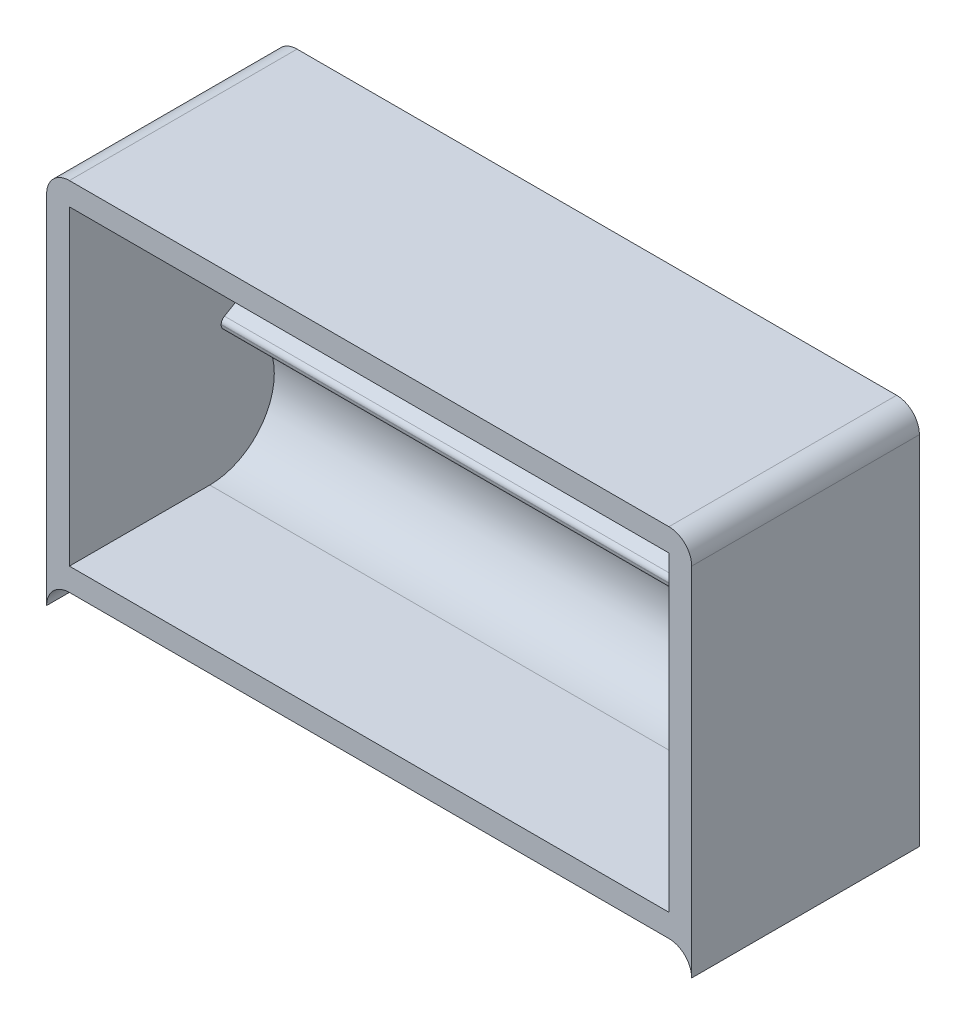
ISO-10303-21;
HEADER;
FILE_DESCRIPTION(('STEP AP214'),'2;1');
FILE_NAME('part.step','',(''),(''),'','','');
FILE_SCHEMA(('AUTOMOTIVE_DESIGN { 1 0 10303 214 1 1 1 1 }'));
ENDSEC;
DATA;
#1=APPLICATION_CONTEXT('core data for automotive mechanical design processes');
#2=APPLICATION_PROTOCOL_DEFINITION('international standard','automotive_design',2000,#1);
#3=PRODUCT_CONTEXT('',#1,'mechanical');
#4=PRODUCT('Part','Part','',(#3));
#5=PRODUCT_RELATED_PRODUCT_CATEGORY('part','',(#4));
#6=PRODUCT_DEFINITION_FORMATION('','',#4);
#7=PRODUCT_DEFINITION_CONTEXT('part definition',#1,'design');
#8=PRODUCT_DEFINITION('design','',#6,#7);
#9=PRODUCT_DEFINITION_SHAPE('','',#8);
#10=(LENGTH_UNIT() NAMED_UNIT(*) SI_UNIT(.MILLI.,.METRE.));
#11=(NAMED_UNIT(*) PLANE_ANGLE_UNIT() SI_UNIT($,.RADIAN.));
#12=(NAMED_UNIT(*) SI_UNIT($,.STERADIAN.) SOLID_ANGLE_UNIT());
#13=UNCERTAINTY_MEASURE_WITH_UNIT(LENGTH_MEASURE(1.E-05),#10,'distance_accuracy_value','');
#14=(GEOMETRIC_REPRESENTATION_CONTEXT(3) GLOBAL_UNCERTAINTY_ASSIGNED_CONTEXT((#13)) GLOBAL_UNIT_ASSIGNED_CONTEXT((#10,
#11,#12)) REPRESENTATION_CONTEXT('',''));
#15=CARTESIAN_POINT('',(0.,0.,0.));
#16=DIRECTION('',(0.,0.,1.));
#17=DIRECTION('',(1.,0.,0.));
#18=AXIS2_PLACEMENT_3D('',#15,#16,#17);
#19=CARTESIAN_POINT('',(82.,44.,30.));
#20=DIRECTION('',(0.,0.,-1.));
#21=DIRECTION('',(-1.,0.,0.));
#22=AXIS2_PLACEMENT_3D('',#19,#20,#21);
#23=CYLINDRICAL_SURFACE('',#22,3.);
#24=CARTESIAN_POINT('',(82.,44.,0.));
#25=DIRECTION('',(0.,0.,1.));
#26=DIRECTION('',(-1.,0.,0.));
#27=AXIS2_PLACEMENT_3D('',#24,#25,#26);
#28=CIRCLE('',#27,3.);
#29=CARTESIAN_POINT('',(85.,44.,0.));
#30=VERTEX_POINT('',#29);
#31=CARTESIAN_POINT('',(82.,47.,0.));
#32=VERTEX_POINT('',#31);
#33=EDGE_CURVE('E154',#30,#32,#28,.T.);
#34=ORIENTED_EDGE('',*,*,#33,.T.);
#35=DIRECTION('',(0.,0.,-1.));
#36=VECTOR('',#35,1.);
#37=CARTESIAN_POINT('',(82.,47.,30.));
#38=LINE('',#37,#36);
#39=CARTESIAN_POINT('',(82.,47.,30.));
#40=VERTEX_POINT('',#39);
#41=EDGE_CURVE('E12',#40,#32,#38,.T.);
#42=ORIENTED_EDGE('',*,*,#41,.F.);
#43=CARTESIAN_POINT('',(82.,44.,30.));
#44=DIRECTION('',(0.,0.,1.));
#45=DIRECTION('',(-1.,0.,0.));
#46=AXIS2_PLACEMENT_3D('',#43,#44,#45);
#47=CIRCLE('',#46,3.);
#48=CARTESIAN_POINT('',(85.,44.,30.));
#49=VERTEX_POINT('',#48);
#50=EDGE_CURVE('E178',#49,#40,#47,.T.);
#51=ORIENTED_EDGE('',*,*,#50,.F.);
#52=DIRECTION('',(0.,0.,-1.));
#53=VECTOR('',#52,1.);
#54=CARTESIAN_POINT('',(85.,44.,30.));
#55=LINE('',#54,#53);
#56=EDGE_CURVE('E150',#49,#30,#55,.T.);
#57=ORIENTED_EDGE('',*,*,#56,.T.);
#58=EDGE_LOOP('',(#34,#42,#51,#57));
#59=FACE_BOUND('',#58,.T.);
#60=ADVANCED_FACE('F41',(#59),#23,.T.);
#61=CARTESIAN_POINT('',(3.,47.,30.));
#62=DIRECTION('',(0.,-1.,0.));
#63=DIRECTION('',(0.,0.,-1.));
#64=AXIS2_PLACEMENT_3D('',#61,#62,#63);
#65=PLANE('',#64);
#66=DIRECTION('',(-1.,0.,0.));
#67=VECTOR('',#66,1.);
#68=CARTESIAN_POINT('',(3.,47.,0.));
#69=LINE('',#68,#67);
#70=CARTESIAN_POINT('',(3.,47.,0.));
#71=VERTEX_POINT('',#70);
#72=EDGE_CURVE('E158',#32,#71,#69,.T.);
#73=ORIENTED_EDGE('',*,*,#72,.T.);
#74=DIRECTION('',(0.,0.,-1.));
#75=VECTOR('',#74,1.);
#76=CARTESIAN_POINT('',(3.,47.,30.));
#77=LINE('',#76,#75);
#78=CARTESIAN_POINT('',(3.,47.,30.));
#79=VERTEX_POINT('',#78);
#80=EDGE_CURVE('E49',#79,#71,#77,.T.);
#81=ORIENTED_EDGE('',*,*,#80,.F.);
#82=DIRECTION('',(-1.,0.,0.));
#83=VECTOR('',#82,1.);
#84=CARTESIAN_POINT('',(3.,47.,30.));
#85=LINE('',#84,#83);
#86=EDGE_CURVE('E106',#40,#79,#85,.T.);
#87=ORIENTED_EDGE('',*,*,#86,.F.);
#88=ORIENTED_EDGE('',*,*,#41,.T.);
#89=EDGE_LOOP('',(#73,#81,#87,#88));
#90=FACE_BOUND('',#89,.T.);
#91=ADVANCED_FACE('F388',(#90),#65,.F.);
#92=CARTESIAN_POINT('',(2.99999999999998,44.,30.));
#93=DIRECTION('',(0.,0.,-1.));
#94=DIRECTION('',(-1.,0.,0.));
#95=AXIS2_PLACEMENT_3D('',#92,#93,#94);
#96=CYLINDRICAL_SURFACE('',#95,3.);
#97=CARTESIAN_POINT('',(2.99999999999998,44.,0.));
#98=DIRECTION('',(0.,0.,1.));
#99=DIRECTION('',(-1.,0.,0.));
#100=AXIS2_PLACEMENT_3D('',#97,#98,#99);
#101=CIRCLE('',#100,3.);
#102=CARTESIAN_POINT('',(0.,44.,0.));
#103=VERTEX_POINT('',#102);
#104=EDGE_CURVE('E162',#71,#103,#101,.T.);
#105=ORIENTED_EDGE('',*,*,#104,.T.);
#106=DIRECTION('',(0.,0.,-1.));
#107=VECTOR('',#106,1.);
#108=CARTESIAN_POINT('',(0.,44.,30.));
#109=LINE('',#108,#107);
#110=CARTESIAN_POINT('',(0.,44.,30.));
#111=VERTEX_POINT('',#110);
#112=EDGE_CURVE('E189',#111,#103,#109,.T.);
#113=ORIENTED_EDGE('',*,*,#112,.F.);
#114=CARTESIAN_POINT('',(2.99999999999998,44.,30.));
#115=DIRECTION('',(0.,0.,1.));
#116=DIRECTION('',(-1.,0.,0.));
#117=AXIS2_PLACEMENT_3D('',#114,#115,#116);
#118=CIRCLE('',#117,3.);
#119=EDGE_CURVE('E199',#79,#111,#118,.T.);
#120=ORIENTED_EDGE('',*,*,#119,.F.);
#121=ORIENTED_EDGE('',*,*,#80,.T.);
#122=EDGE_LOOP('',(#105,#113,#120,#121));
#123=FACE_BOUND('',#122,.T.);
#124=ADVANCED_FACE('F197',(#123),#96,.T.);
#125=CARTESIAN_POINT('',(-3.33066907387547E-13,-3.,30.));
#126=DIRECTION('',(1.,0.,0.));
#127=DIRECTION('',(0.,1.,0.));
#128=AXIS2_PLACEMENT_3D('',#125,#126,#127);
#129=PLANE('',#128);
#130=DIRECTION('',(0.,-1.,0.));
#131=VECTOR('',#130,1.);
#132=CARTESIAN_POINT('',(-3.33066907387547E-13,-3.,0.));
#133=LINE('',#132,#131);
#134=CARTESIAN_POINT('',(-3.33066907387547E-13,-3.,0.));
#135=VERTEX_POINT('',#134);
#136=EDGE_CURVE('E165',#103,#135,#133,.T.);
#137=ORIENTED_EDGE('',*,*,#136,.T.);
#138=DIRECTION('',(0.,0.,-1.));
#139=VECTOR('',#138,1.);
#140=CARTESIAN_POINT('',(-3.33066907387547E-13,-3.,30.));
#141=LINE('',#140,#139);
#142=CARTESIAN_POINT('',(-3.33066907387547E-13,-3.,30.));
#143=VERTEX_POINT('',#142);
#144=EDGE_CURVE('E185',#143,#135,#141,.T.);
#145=ORIENTED_EDGE('',*,*,#144,.F.);
#146=DIRECTION('',(0.,-1.,0.));
#147=VECTOR('',#146,1.);
#148=CARTESIAN_POINT('',(-3.33066907387547E-13,-3.,30.));
#149=LINE('',#148,#147);
#150=EDGE_CURVE('E212',#111,#143,#149,.T.);
#151=ORIENTED_EDGE('',*,*,#150,.F.);
#152=ORIENTED_EDGE('',*,*,#112,.T.);
#153=EDGE_LOOP('',(#137,#145,#151,#152));
#154=FACE_BOUND('',#153,.T.);
#155=ADVANCED_FACE('F207',(#154),#129,.F.);
#156=CARTESIAN_POINT('',(2.99999999999966,-3.,30.));
#157=DIRECTION('',(0.,0.,-1.));
#158=DIRECTION('',(-1.,0.,0.));
#159=AXIS2_PLACEMENT_3D('',#156,#157,#158);
#160=CYLINDRICAL_SURFACE('',#159,3.);
#161=CARTESIAN_POINT('',(2.99999999999966,-3.,0.));
#162=DIRECTION('',(0.,0.,-1.));
#163=DIRECTION('',(1.,0.,0.));
#164=AXIS2_PLACEMENT_3D('',#161,#162,#163);
#165=CIRCLE('',#164,3.);
#166=CARTESIAN_POINT('',(2.99999999999966,0.,0.));
#167=VERTEX_POINT('',#166);
#168=EDGE_CURVE('E168',#135,#167,#165,.T.);
#169=ORIENTED_EDGE('',*,*,#168,.T.);
#170=DIRECTION('',(0.,0.,-1.));
#171=VECTOR('',#170,1.);
#172=CARTESIAN_POINT('',(2.99999999999966,0.,30.));
#173=LINE('',#172,#171);
#174=CARTESIAN_POINT('',(2.99999999999966,0.,30.));
#175=VERTEX_POINT('',#174);
#176=EDGE_CURVE('E143',#175,#167,#173,.T.);
#177=ORIENTED_EDGE('',*,*,#176,.F.);
#178=CARTESIAN_POINT('',(2.99999999999966,-3.,30.));
#179=DIRECTION('',(0.,0.,-1.));
#180=DIRECTION('',(1.,0.,0.));
#181=AXIS2_PLACEMENT_3D('',#178,#179,#180);
#182=CIRCLE('',#181,3.);
#183=EDGE_CURVE('E129',#143,#175,#182,.T.);
#184=ORIENTED_EDGE('',*,*,#183,.F.);
#185=ORIENTED_EDGE('',*,*,#144,.T.);
#186=EDGE_LOOP('',(#169,#177,#184,#185));
#187=FACE_BOUND('',#186,.T.);
#188=ADVANCED_FACE('F210',(#187),#160,.F.);
#189=CARTESIAN_POINT('',(2.99999999999966,0.,30.));
#190=DIRECTION('',(0.,1.,0.));
#191=DIRECTION('',(0.,0.,1.));
#192=AXIS2_PLACEMENT_3D('',#189,#190,#191);
#193=PLANE('',#192);
#194=DIRECTION('',(1.,0.,0.));
#195=VECTOR('',#194,1.);
#196=CARTESIAN_POINT('',(2.99999999999966,0.,0.));
#197=LINE('',#196,#195);
#198=CARTESIAN_POINT('',(82.0000000000004,0.,0.));
#199=VERTEX_POINT('',#198);
#200=EDGE_CURVE('E139',#167,#199,#197,.T.);
#201=ORIENTED_EDGE('',*,*,#200,.T.);
#202=DIRECTION('',(0.,0.,-1.));
#203=VECTOR('',#202,1.);
#204=CARTESIAN_POINT('',(82.0000000000004,0.,30.));
#205=LINE('',#204,#203);
#206=CARTESIAN_POINT('',(82.0000000000004,0.,30.));
#207=VERTEX_POINT('',#206);
#208=EDGE_CURVE('E136',#207,#199,#205,.T.);
#209=ORIENTED_EDGE('',*,*,#208,.F.);
#210=DIRECTION('',(1.,0.,0.));
#211=VECTOR('',#210,1.);
#212=CARTESIAN_POINT('',(2.99999999999966,0.,30.));
#213=LINE('',#212,#211);
#214=EDGE_CURVE('E122',#175,#207,#213,.T.);
#215=ORIENTED_EDGE('',*,*,#214,.F.);
#216=ORIENTED_EDGE('',*,*,#176,.T.);
#217=EDGE_LOOP('',(#201,#209,#215,#216));
#218=FACE_BOUND('',#217,.T.);
#219=ADVANCED_FACE('F137',(#218),#193,.F.);
#220=CARTESIAN_POINT('',(82.0000000000004,-3.,30.));
#221=DIRECTION('',(0.,0.,-1.));
#222=DIRECTION('',(-1.,0.,0.));
#223=AXIS2_PLACEMENT_3D('',#220,#221,#222);
#224=CYLINDRICAL_SURFACE('',#223,3.);
#225=CARTESIAN_POINT('',(82.0000000000004,-3.,0.));
#226=DIRECTION('',(0.,0.,-1.));
#227=DIRECTION('',(-1.,0.,0.));
#228=AXIS2_PLACEMENT_3D('',#225,#226,#227);
#229=CIRCLE('',#228,3.);
#230=CARTESIAN_POINT('',(85.0000000000004,-3.,0.));
#231=VERTEX_POINT('',#230);
#232=EDGE_CURVE('E173',#199,#231,#229,.T.);
#233=ORIENTED_EDGE('',*,*,#232,.T.);
#234=DIRECTION('',(0.,0.,-1.));
#235=VECTOR('',#234,1.);
#236=CARTESIAN_POINT('',(85.0000000000004,-3.,30.));
#237=LINE('',#236,#235);
#238=CARTESIAN_POINT('',(85.0000000000004,-3.,30.));
#239=VERTEX_POINT('',#238);
#240=EDGE_CURVE('E144',#239,#231,#237,.T.);
#241=ORIENTED_EDGE('',*,*,#240,.F.);
#242=CARTESIAN_POINT('',(82.0000000000004,-3.,30.));
#243=DIRECTION('',(0.,0.,-1.));
#244=DIRECTION('',(-1.,0.,0.));
#245=AXIS2_PLACEMENT_3D('',#242,#243,#244);
#246=CIRCLE('',#245,3.);
#247=EDGE_CURVE('E126',#207,#239,#246,.T.);
#248=ORIENTED_EDGE('',*,*,#247,.F.);
#249=ORIENTED_EDGE('',*,*,#208,.T.);
#250=EDGE_LOOP('',(#233,#241,#248,#249));
#251=FACE_BOUND('',#250,.T.);
#252=ADVANCED_FACE('F146',(#251),#224,.F.);
#253=CARTESIAN_POINT('',(85.,44.,30.));
#254=DIRECTION('',(-1.,0.,0.));
#255=DIRECTION('',(0.,-1.,0.));
#256=AXIS2_PLACEMENT_3D('',#253,#254,#255);
#257=PLANE('',#256);
#258=DIRECTION('',(0.,1.,0.));
#259=VECTOR('',#258,1.);
#260=CARTESIAN_POINT('',(85.,44.,0.));
#261=LINE('',#260,#259);
#262=EDGE_CURVE('E98',#231,#30,#261,.T.);
#263=ORIENTED_EDGE('',*,*,#262,.T.);
#264=ORIENTED_EDGE('',*,*,#56,.F.);
#265=DIRECTION('',(0.,1.,0.));
#266=VECTOR('',#265,1.);
#267=CARTESIAN_POINT('',(85.,44.,30.));
#268=LINE('',#267,#266);
#269=EDGE_CURVE('E65',#239,#49,#268,.T.);
#270=ORIENTED_EDGE('',*,*,#269,.F.);
#271=ORIENTED_EDGE('',*,*,#240,.T.);
#272=EDGE_LOOP('',(#263,#264,#270,#271));
#273=FACE_BOUND('',#272,.T.);
#274=ADVANCED_FACE('F395',(#273),#257,.F.);
#275=CARTESIAN_POINT('',(82.,44.,30.));
#276=DIRECTION('',(0.,0.,-1.));
#277=DIRECTION('',(-1.,0.,0.));
#278=AXIS2_PLACEMENT_3D('',#275,#276,#277);
#279=PLANE('',#278);
#280=DIRECTION('',(1.,0.,0.));
#281=VECTOR('',#280,1.);
#282=CARTESIAN_POINT('',(-49.0917508345346,43.999999999999,30.));
#283=LINE('',#282,#281);
#284=CARTESIAN_POINT('',(2.99999999999999,43.9999999999994,30.));
#285=VERTEX_POINT('',#284);
#286=CARTESIAN_POINT('',(82.,44.,30.));
#287=VERTEX_POINT('',#286);
#288=EDGE_CURVE('E56',#285,#287,#283,.T.);
#289=ORIENTED_EDGE('',*,*,#288,.T.);
#290=DIRECTION('',(0.,-1.,0.));
#291=VECTOR('',#290,1.);
#292=CARTESIAN_POINT('',(82.0000000000003,2.99999999999998,30.));
#293=LINE('',#292,#291);
#294=CARTESIAN_POINT('',(82.0000000000003,2.99999999999998,30.));
#295=VERTEX_POINT('',#294);
#296=EDGE_CURVE('E273',#287,#295,#293,.T.);
#297=ORIENTED_EDGE('',*,*,#296,.T.);
#298=DIRECTION('',(1.,0.,0.));
#299=VECTOR('',#298,1.);
#300=CARTESIAN_POINT('',(-49.0917508345343,2.99999999999905,30.));
#301=LINE('',#300,#299);
#302=CARTESIAN_POINT('',(2.99999999999971,2.99999999999905,30.));
#303=VERTEX_POINT('',#302);
#304=EDGE_CURVE('E237',#303,#295,#301,.T.);
#305=ORIENTED_EDGE('',*,*,#304,.F.);
#306=DIRECTION('',(0.,1.,0.));
#307=VECTOR('',#306,1.);
#308=CARTESIAN_POINT('',(2.99999999999971,2.99999999999871,30.));
#309=LINE('',#308,#307);
#310=EDGE_CURVE('E307',#303,#285,#309,.T.);
#311=ORIENTED_EDGE('',*,*,#310,.T.);
#312=EDGE_LOOP('',(#289,#297,#305,#311));
#313=FACE_BOUND('',#312,.T.);
#314=ORIENTED_EDGE('',*,*,#50,.T.);
#315=ORIENTED_EDGE('',*,*,#86,.T.);
#316=ORIENTED_EDGE('',*,*,#119,.T.);
#317=ORIENTED_EDGE('',*,*,#150,.T.);
#318=ORIENTED_EDGE('',*,*,#183,.T.);
#319=ORIENTED_EDGE('',*,*,#214,.T.);
#320=ORIENTED_EDGE('',*,*,#247,.T.);
#321=ORIENTED_EDGE('',*,*,#269,.T.);
#322=EDGE_LOOP('',(#314,#315,#316,#317,#318,#319,#320,#321));
#323=FACE_BOUND('',#322,.T.);
#324=ADVANCED_FACE('F124',(#313,#323),#279,.F.);
#325=CARTESIAN_POINT('',(82.,44.,0.));
#326=DIRECTION('',(0.,0.,-1.));
#327=DIRECTION('',(-1.,0.,0.));
#328=AXIS2_PLACEMENT_3D('',#325,#326,#327);
#329=PLANE('',#328);
#330=ORIENTED_EDGE('',*,*,#33,.F.);
#331=ORIENTED_EDGE('',*,*,#262,.F.);
#332=ORIENTED_EDGE('',*,*,#232,.F.);
#333=ORIENTED_EDGE('',*,*,#200,.F.);
#334=ORIENTED_EDGE('',*,*,#168,.F.);
#335=ORIENTED_EDGE('',*,*,#136,.F.);
#336=ORIENTED_EDGE('',*,*,#104,.F.);
#337=ORIENTED_EDGE('',*,*,#72,.F.);
#338=EDGE_LOOP('',(#330,#331,#332,#333,#334,#335,#336,#337));
#339=FACE_BOUND('',#338,.T.);
#340=ADVANCED_FACE('F203',(#339),#329,.T.);
#341=CARTESIAN_POINT('',(-49.0917508345345,20.5894785395223,9.2));
#342=DIRECTION('',(1.,0.,0.));
#343=DIRECTION('',(0.,1.,0.));
#344=AXIS2_PLACEMENT_3D('',#341,#342,#343);
#345=CYLINDRICAL_SURFACE('',#344,0.800000000000001);
#346=CARTESIAN_POINT('',(2.99999999999983,20.5894785395227,9.2));
#347=DIRECTION('',(1.,0.,0.));
#348=DIRECTION('',(0.,1.,0.));
#349=AXIS2_PLACEMENT_3D('',#346,#347,#348);
#350=CIRCLE('',#349,0.800000000000001);
#351=CARTESIAN_POINT('',(2.99999999999983,21.3026361308025,9.56249999999996));
#352=VERTEX_POINT('',#351);
#353=CARTESIAN_POINT('',(2.99999999999983,20.5894785395232,10.));
#354=VERTEX_POINT('',#353);
#355=EDGE_CURVE('E225',#352,#354,#350,.T.);
#356=ORIENTED_EDGE('',*,*,#355,.T.);
#357=DIRECTION('',(1.,0.,0.));
#358=VECTOR('',#357,1.);
#359=CARTESIAN_POINT('',(-49.0917508345345,20.5894785395223,10.));
#360=LINE('',#359,#358);
#361=CARTESIAN_POINT('',(82.0000000000002,20.5894785395232,10.));
#362=VERTEX_POINT('',#361);
#363=EDGE_CURVE('E253',#354,#362,#360,.T.);
#364=ORIENTED_EDGE('',*,*,#363,.T.);
#365=CARTESIAN_POINT('',(82.0000000000002,20.5894785395232,9.2));
#366=DIRECTION('',(-1.,0.,0.));
#367=DIRECTION('',(0.,1.,0.));
#368=AXIS2_PLACEMENT_3D('',#365,#366,#367);
#369=CIRCLE('',#368,0.800000000000001);
#370=CARTESIAN_POINT('',(82.0000000000002,21.302636130803,9.5625));
#371=VERTEX_POINT('',#370);
#372=EDGE_CURVE('E284',#362,#371,#369,.T.);
#373=ORIENTED_EDGE('',*,*,#372,.T.);
#374=DIRECTION('',(1.,0.,0.));
#375=VECTOR('',#374,1.);
#376=CARTESIAN_POINT('',(-49.0917508345345,21.3026361308021,9.5625));
#377=LINE('',#376,#375);
#378=EDGE_CURVE('E226',#352,#371,#377,.T.);
#379=ORIENTED_EDGE('',*,*,#378,.F.);
#380=EDGE_LOOP('',(#356,#364,#373,#379));
#381=FACE_BOUND('',#380,.T.);
#382=ADVANCED_FACE('F334',(#381),#345,.T.);
#383=CARTESIAN_POINT('',(-49.0917508345345,20.5111042608541,10.));
#384=DIRECTION('',(0.,0.,-1.));
#385=DIRECTION('',(-1.,0.,0.));
#386=AXIS2_PLACEMENT_3D('',#383,#384,#385);
#387=PLANE('',#386);
#388=DIRECTION('',(0.,-1.,0.));
#389=VECTOR('',#388,1.);
#390=CARTESIAN_POINT('',(2.99999999999983,20.5111042608538,10.));
#391=LINE('',#390,#389);
#392=CARTESIAN_POINT('',(2.99999999999983,20.5111042608546,10.));
#393=VERTEX_POINT('',#392);
#394=EDGE_CURVE('E291',#354,#393,#391,.T.);
#395=ORIENTED_EDGE('',*,*,#394,.T.);
#396=DIRECTION('',(1.,0.,0.));
#397=VECTOR('',#396,1.);
#398=CARTESIAN_POINT('',(-49.0917508345345,20.5111042608541,10.));
#399=LINE('',#398,#397);
#400=CARTESIAN_POINT('',(82.0000000000002,20.511104260855,10.));
#401=VERTEX_POINT('',#400);
#402=EDGE_CURVE('E249',#393,#401,#399,.T.);
#403=ORIENTED_EDGE('',*,*,#402,.T.);
#404=DIRECTION('',(-1.77070692625684E-13,1.,0.));
#405=VECTOR('',#404,1.);
#406=CARTESIAN_POINT('',(82.0000000000002,20.511104260855,10.));
#407=LINE('',#406,#405);
#408=EDGE_CURVE('E231',#401,#362,#407,.T.);
#409=ORIENTED_EDGE('',*,*,#408,.T.);
#410=ORIENTED_EDGE('',*,*,#363,.F.);
#411=EDGE_LOOP('',(#395,#403,#409,#410));
#412=FACE_BOUND('',#411,.T.);
#413=ADVANCED_FACE('F377',(#412),#387,.F.);
#414=CARTESIAN_POINT('',(-49.0917508345345,20.5111042608541,9.2));
#415=DIRECTION('',(1.,0.,0.));
#416=DIRECTION('',(0.,1.,0.));
#417=AXIS2_PLACEMENT_3D('',#414,#415,#416);
#418=CYLINDRICAL_SURFACE('',#417,0.8);
#419=CARTESIAN_POINT('',(2.99999999999983,20.5111042608545,9.2));
#420=DIRECTION('',(1.,0.,0.));
#421=DIRECTION('',(0.,1.,0.));
#422=AXIS2_PLACEMENT_3D('',#419,#420,#421);
#423=CIRCLE('',#422,0.8);
#424=CARTESIAN_POINT('',(2.99999999999982,19.7359555072325,9.39784946236562));
#425=VERTEX_POINT('',#424);
#426=EDGE_CURVE('E295',#393,#425,#423,.T.);
#427=ORIENTED_EDGE('',*,*,#426,.T.);
#428=DIRECTION('',(1.,0.,0.));
#429=VECTOR('',#428,1.);
#430=CARTESIAN_POINT('',(-49.0917508345345,19.7359555072322,9.39784946236559));
#431=LINE('',#430,#429);
#432=CARTESIAN_POINT('',(82.0000000000002,19.7359555072331,9.39784946236559));
#433=VERTEX_POINT('',#432);
#434=EDGE_CURVE('E245',#425,#433,#431,.T.);
#435=ORIENTED_EDGE('',*,*,#434,.T.);
#436=CARTESIAN_POINT('',(82.0000000000002,20.511104260855,9.2));
#437=DIRECTION('',(-1.,0.,0.));
#438=DIRECTION('',(0.,-1.,0.));
#439=AXIS2_PLACEMENT_3D('',#436,#437,#438);
#440=CIRCLE('',#439,0.8);
#441=EDGE_CURVE('E261',#433,#401,#440,.T.);
#442=ORIENTED_EDGE('',*,*,#441,.T.);
#443=ORIENTED_EDGE('',*,*,#402,.F.);
#444=EDGE_LOOP('',(#427,#435,#442,#443));
#445=FACE_BOUND('',#444,.T.);
#446=ADVANCED_FACE('F375',(#445),#418,.T.);
#447=CARTESIAN_POINT('',(-49.0917508345344,11.4999999999991,11.5));
#448=DIRECTION('',(1.,0.,0.));
#449=DIRECTION('',(0.,1.,0.));
#450=AXIS2_PLACEMENT_3D('',#447,#448,#449);
#451=CYLINDRICAL_SURFACE('',#450,8.5);
#452=CARTESIAN_POINT('',(2.99999999999977,11.4999999999994,11.5));
#453=DIRECTION('',(1.,0.,0.));
#454=DIRECTION('',(0.,1.,0.));
#455=AXIS2_PLACEMENT_3D('',#452,#453,#454);
#456=CIRCLE('',#455,8.5);
#457=CARTESIAN_POINT('',(2.99999999999971,2.99999999999942,11.5));
#458=VERTEX_POINT('',#457);
#459=EDGE_CURVE('E299',#425,#458,#456,.F.);
#460=ORIENTED_EDGE('',*,*,#459,.T.);
#461=DIRECTION('',(1.,0.,0.));
#462=VECTOR('',#461,1.);
#463=CARTESIAN_POINT('',(-49.0917508345343,2.99999999999905,11.5));
#464=LINE('',#463,#462);
#465=CARTESIAN_POINT('',(82.0000000000003,2.99999999999998,11.5));
#466=VERTEX_POINT('',#465);
#467=EDGE_CURVE('E241',#458,#466,#464,.T.);
#468=ORIENTED_EDGE('',*,*,#467,.T.);
#469=CARTESIAN_POINT('',(82.0000000000002,11.5,11.5));
#470=DIRECTION('',(1.,0.,0.));
#471=DIRECTION('',(0.,1.,0.));
#472=AXIS2_PLACEMENT_3D('',#469,#470,#471);
#473=CIRCLE('',#472,8.5);
#474=EDGE_CURVE('E265',#466,#433,#473,.T.);
#475=ORIENTED_EDGE('',*,*,#474,.T.);
#476=ORIENTED_EDGE('',*,*,#434,.F.);
#477=EDGE_LOOP('',(#460,#468,#475,#476));
#478=FACE_BOUND('',#477,.T.);
#479=ADVANCED_FACE('F372',(#478),#451,.F.);
#480=CARTESIAN_POINT('',(-49.0917508345343,2.99999999999905,30.));
#481=DIRECTION('',(0.,-1.,0.));
#482=DIRECTION('',(1.,0.,0.));
#483=AXIS2_PLACEMENT_3D('',#480,#481,#482);
#484=PLANE('',#483);
#485=DIRECTION('',(0.,0.,1.));
#486=VECTOR('',#485,1.);
#487=CARTESIAN_POINT('',(2.99999999999971,2.99999999999942,30.));
#488=LINE('',#487,#486);
#489=EDGE_CURVE('E303',#458,#303,#488,.T.);
#490=ORIENTED_EDGE('',*,*,#489,.T.);
#491=ORIENTED_EDGE('',*,*,#304,.T.);
#492=DIRECTION('',(0.,0.,-1.));
#493=VECTOR('',#492,1.);
#494=CARTESIAN_POINT('',(82.0000000000003,2.99999999999998,30.));
#495=LINE('',#494,#493);
#496=EDGE_CURVE('E269',#295,#466,#495,.T.);
#497=ORIENTED_EDGE('',*,*,#496,.T.);
#498=ORIENTED_EDGE('',*,*,#467,.F.);
#499=EDGE_LOOP('',(#490,#491,#497,#498));
#500=FACE_BOUND('',#499,.T.);
#501=ADVANCED_FACE('F367',(#500),#484,.F.);
#502=CARTESIAN_POINT('',(-49.0917508345346,43.999999999999,30.));
#503=DIRECTION('',(0.,1.,0.));
#504=DIRECTION('',(-1.,0.,0.));
#505=AXIS2_PLACEMENT_3D('',#502,#503,#504);
#506=PLANE('',#505);
#507=DIRECTION('',(0.,0.,-1.));
#508=VECTOR('',#507,1.);
#509=CARTESIAN_POINT('',(2.99999999999998,43.9999999999994,30.));
#510=LINE('',#509,#508);
#511=CARTESIAN_POINT('',(2.99999999999999,43.9999999999994,15.));
#512=VERTEX_POINT('',#511);
#513=EDGE_CURVE('E257',#285,#512,#510,.T.);
#514=ORIENTED_EDGE('',*,*,#513,.T.);
#515=DIRECTION('',(1.,0.,0.));
#516=VECTOR('',#515,1.);
#517=CARTESIAN_POINT('',(-49.0917508345346,43.9999999999991,15.));
#518=LINE('',#517,#516);
#519=CARTESIAN_POINT('',(82.,44.,15.));
#520=VERTEX_POINT('',#519);
#521=EDGE_CURVE('E230',#512,#520,#518,.T.);
#522=ORIENTED_EDGE('',*,*,#521,.T.);
#523=DIRECTION('',(0.,0.,1.));
#524=VECTOR('',#523,1.);
#525=CARTESIAN_POINT('',(82.,44.,30.));
#526=LINE('',#525,#524);
#527=EDGE_CURVE('E277',#520,#287,#526,.T.);
#528=ORIENTED_EDGE('',*,*,#527,.T.);
#529=ORIENTED_EDGE('',*,*,#288,.F.);
#530=EDGE_LOOP('',(#514,#522,#528,#529));
#531=FACE_BOUND('',#530,.T.);
#532=ADVANCED_FACE('F314',(#531),#506,.F.);
#533=CARTESIAN_POINT('',(-49.0917508345345,31.999999999999,15.));
#534=DIRECTION('',(1.,0.,0.));
#535=DIRECTION('',(0.,1.,0.));
#536=AXIS2_PLACEMENT_3D('',#533,#534,#535);
#537=CYLINDRICAL_SURFACE('',#536,12.);
#538=CARTESIAN_POINT('',(2.99999999999991,31.9999999999994,15.));
#539=DIRECTION('',(1.,0.,0.));
#540=DIRECTION('',(0.,1.,0.));
#541=AXIS2_PLACEMENT_3D('',#538,#539,#540);
#542=CIRCLE('',#541,12.);
#543=EDGE_CURVE('E159',#512,#352,#542,.F.);
#544=ORIENTED_EDGE('',*,*,#543,.T.);
#545=ORIENTED_EDGE('',*,*,#378,.T.);
#546=CARTESIAN_POINT('',(82.0000000000001,32.,15.));
#547=DIRECTION('',(1.,0.,0.));
#548=DIRECTION('',(0.,1.,0.));
#549=AXIS2_PLACEMENT_3D('',#546,#547,#548);
#550=CIRCLE('',#549,12.);
#551=EDGE_CURVE('E280',#371,#520,#550,.T.);
#552=ORIENTED_EDGE('',*,*,#551,.T.);
#553=ORIENTED_EDGE('',*,*,#521,.F.);
#554=EDGE_LOOP('',(#544,#545,#552,#553));
#555=FACE_BOUND('',#554,.T.);
#556=ADVANCED_FACE('F324',(#555),#537,.F.);
#557=CARTESIAN_POINT('',(82.0000000000002,20.5894785395232,9.2));
#558=DIRECTION('',(1.,0.,0.));
#559=DIRECTION('',(0.,1.,0.));
#560=AXIS2_PLACEMENT_3D('',#557,#558,#559);
#561=PLANE('',#560);
#562=ORIENTED_EDGE('',*,*,#372,.F.);
#563=ORIENTED_EDGE('',*,*,#408,.F.);
#564=ORIENTED_EDGE('',*,*,#441,.F.);
#565=ORIENTED_EDGE('',*,*,#474,.F.);
#566=ORIENTED_EDGE('',*,*,#496,.F.);
#567=ORIENTED_EDGE('',*,*,#296,.F.);
#568=ORIENTED_EDGE('',*,*,#527,.F.);
#569=ORIENTED_EDGE('',*,*,#551,.F.);
#570=EDGE_LOOP('',(#562,#563,#564,#565,#566,#567,#568,#569));
#571=FACE_BOUND('',#570,.T.);
#572=ADVANCED_FACE('F339',(#571),#561,.F.);
#573=CARTESIAN_POINT('',(2.99999999999967,-3.00000000000002,30.));
#574=DIRECTION('',(1.,0.,0.));
#575=DIRECTION('',(0.,1.,0.));
#576=AXIS2_PLACEMENT_3D('',#573,#574,#575);
#577=PLANE('',#576);
#578=ORIENTED_EDGE('',*,*,#355,.F.);
#579=ORIENTED_EDGE('',*,*,#543,.F.);
#580=ORIENTED_EDGE('',*,*,#513,.F.);
#581=ORIENTED_EDGE('',*,*,#310,.F.);
#582=ORIENTED_EDGE('',*,*,#489,.F.);
#583=ORIENTED_EDGE('',*,*,#459,.F.);
#584=ORIENTED_EDGE('',*,*,#426,.F.);
#585=ORIENTED_EDGE('',*,*,#394,.F.);
#586=EDGE_LOOP('',(#578,#579,#580,#581,#582,#583,#584,#585));
#587=FACE_BOUND('',#586,.T.);
#588=ADVANCED_FACE('F327',(#587),#577,.T.);
#589=CLOSED_SHELL('',(#60,#91,#124,#155,#188,#219,#252,#274,#324,#340,#382,#413,#446,#479,#501,
#532,#556,#572,#588));
#590=MANIFOLD_SOLID_BREP('B2',#589);
#591=ADVANCED_BREP_SHAPE_REPRESENTATION('',(#18,#590),#14);
#592=SHAPE_DEFINITION_REPRESENTATION(#9,#591);
ENDSEC;
END-ISO-10303-21;
